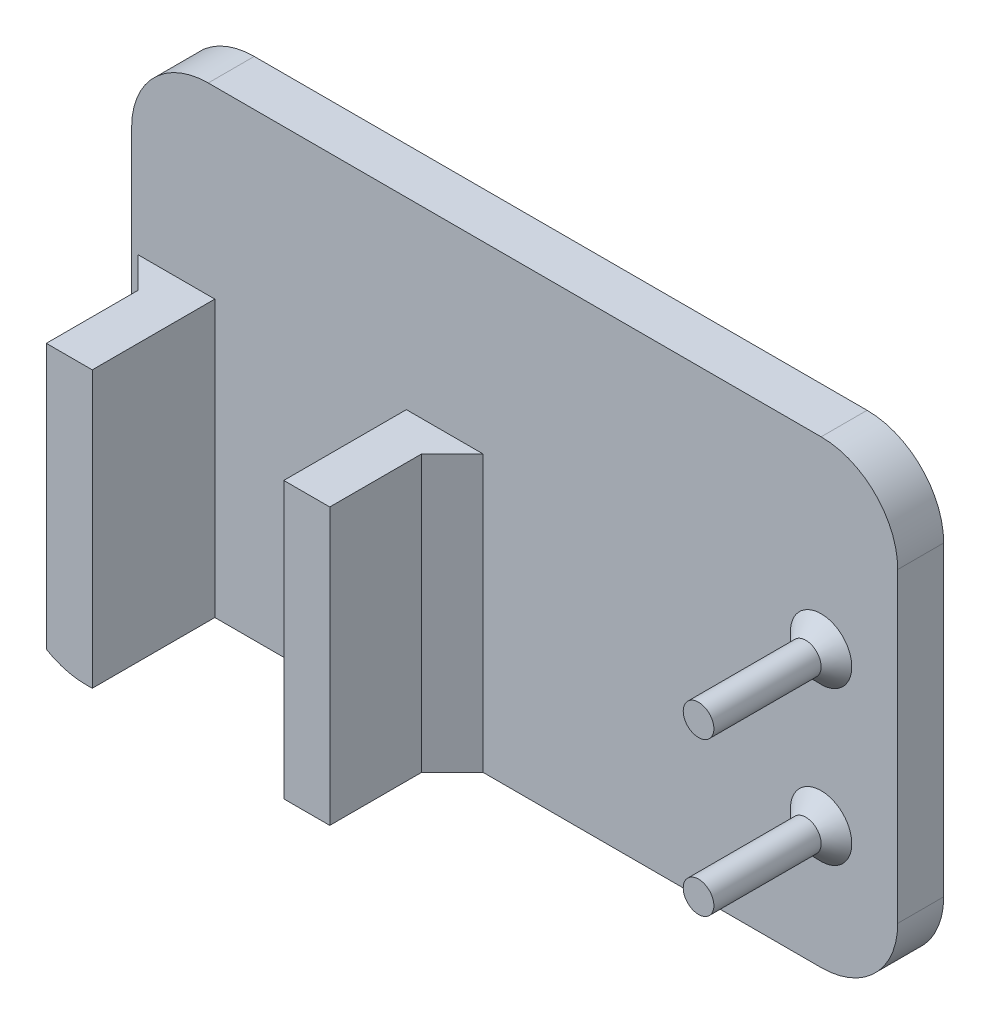
ISO-10303-21;
HEADER;
FILE_DESCRIPTION(('STEP AP214'),'2;1');
FILE_NAME('part.step','',(''),(''),'','','');
FILE_SCHEMA(('AUTOMOTIVE_DESIGN { 1 0 10303 214 1 1 1 1 }'));
ENDSEC;
DATA;
#1=APPLICATION_CONTEXT('core data for automotive mechanical design processes');
#2=APPLICATION_PROTOCOL_DEFINITION('international standard','automotive_design',2000,#1);
#3=PRODUCT_CONTEXT('',#1,'mechanical');
#4=PRODUCT('Part','Part','',(#3));
#5=PRODUCT_RELATED_PRODUCT_CATEGORY('part','',(#4));
#6=PRODUCT_DEFINITION_FORMATION('','',#4);
#7=PRODUCT_DEFINITION_CONTEXT('part definition',#1,'design');
#8=PRODUCT_DEFINITION('design','',#6,#7);
#9=PRODUCT_DEFINITION_SHAPE('','',#8);
#10=(LENGTH_UNIT() NAMED_UNIT(*) SI_UNIT(.MILLI.,.METRE.));
#11=(NAMED_UNIT(*) PLANE_ANGLE_UNIT() SI_UNIT($,.RADIAN.));
#12=(NAMED_UNIT(*) SI_UNIT($,.STERADIAN.) SOLID_ANGLE_UNIT());
#13=UNCERTAINTY_MEASURE_WITH_UNIT(LENGTH_MEASURE(1.E-05),#10,'distance_accuracy_value','');
#14=(GEOMETRIC_REPRESENTATION_CONTEXT(3) GLOBAL_UNCERTAINTY_ASSIGNED_CONTEXT((#13)) GLOBAL_UNIT_ASSIGNED_CONTEXT((#10,
#11,#12)) REPRESENTATION_CONTEXT('',''));
#15=CARTESIAN_POINT('',(0.,0.,0.));
#16=DIRECTION('',(0.,0.,1.));
#17=DIRECTION('',(1.,0.,0.));
#18=AXIS2_PLACEMENT_3D('',#15,#16,#17);
#19=CARTESIAN_POINT('',(0.,0.,3.));
#20=DIRECTION('',(0.,0.,-1.));
#21=DIRECTION('',(-1.,0.,0.));
#22=AXIS2_PLACEMENT_3D('',#19,#20,#21);
#23=PLANE('',#22);
#24=CARTESIAN_POINT('',(45.,18.,3.));
#25=DIRECTION('',(0.,0.,-1.));
#26=DIRECTION('',(-1.,0.,0.));
#27=AXIS2_PLACEMENT_3D('',#24,#25,#26);
#28=CIRCLE('',#27,2.);
#29=CARTESIAN_POINT('',(43.,18.,3.));
#30=VERTEX_POINT('',#29);
#31=EDGE_CURVE('E48',#30,#30,#28,.T.);
#32=ORIENTED_EDGE('',*,*,#31,.T.);
#33=EDGE_LOOP('',(#32));
#34=FACE_BOUND('',#33,.T.);
#35=CARTESIAN_POINT('',(45.,8.00000000000001,3.));
#36=DIRECTION('',(0.,0.,-1.));
#37=DIRECTION('',(-1.,0.,0.));
#38=AXIS2_PLACEMENT_3D('',#35,#36,#37);
#39=CIRCLE('',#38,2.);
#40=CARTESIAN_POINT('',(43.,8.00000000000001,3.));
#41=VERTEX_POINT('',#40);
#42=EDGE_CURVE('E368',#41,#41,#39,.T.);
#43=ORIENTED_EDGE('',*,*,#42,.T.);
#44=EDGE_LOOP('',(#43));
#45=FACE_BOUND('',#44,.T.);
#46=DIRECTION('',(0.,-1.,0.));
#47=VECTOR('',#46,1.);
#48=CARTESIAN_POINT('',(0.,0.,3.));
#49=LINE('',#48,#47);
#50=CARTESIAN_POINT('',(0.,25.,3.));
#51=VERTEX_POINT('',#50);
#52=CARTESIAN_POINT('',(0.,5.,3.));
#53=VERTEX_POINT('',#52);
#54=EDGE_CURVE('E251',#51,#53,#49,.T.);
#55=ORIENTED_EDGE('',*,*,#54,.T.);
#56=CARTESIAN_POINT('',(5.,5.,3.));
#57=DIRECTION('',(0.,0.,-1.));
#58=DIRECTION('',(-1.,0.,0.));
#59=AXIS2_PLACEMENT_3D('',#56,#57,#58);
#60=CIRCLE('',#59,5.);
#61=CARTESIAN_POINT('',(0.430461557222115,2.97038958911444,3.));
#62=VERTEX_POINT('',#61);
#63=EDGE_CURVE('E340',#53,#62,#60,.F.);
#64=ORIENTED_EDGE('',*,*,#63,.T.);
#65=DIRECTION('',(0.,1.,0.));
#66=VECTOR('',#65,1.);
#67=CARTESIAN_POINT('',(0.430461557222114,18.,3.));
#68=LINE('',#67,#66);
#69=CARTESIAN_POINT('',(0.430461557222114,18.,3.));
#70=VERTEX_POINT('',#69);
#71=EDGE_CURVE('E269',#62,#70,#68,.T.);
#72=ORIENTED_EDGE('',*,*,#71,.T.);
#73=DIRECTION('',(-1.,0.,0.));
#74=VECTOR('',#73,1.);
#75=CARTESIAN_POINT('',(0.,18.,3.));
#76=LINE('',#75,#74);
#77=CARTESIAN_POINT('',(5.43046155722212,18.,3.));
#78=VERTEX_POINT('',#77);
#79=EDGE_CURVE('E224',#78,#70,#76,.T.);
#80=ORIENTED_EDGE('',*,*,#79,.F.);
#81=DIRECTION('',(0.,-1.,0.));
#82=VECTOR('',#81,1.);
#83=CARTESIAN_POINT('',(5.43046155722212,0.,3.));
#84=LINE('',#83,#82);
#85=CARTESIAN_POINT('',(5.43046155722212,0.,3.));
#86=VERTEX_POINT('',#85);
#87=EDGE_CURVE('E180',#78,#86,#84,.T.);
#88=ORIENTED_EDGE('',*,*,#87,.T.);
#89=DIRECTION('',(1.,0.,0.));
#90=VECTOR('',#89,1.);
#91=CARTESIAN_POINT('',(0.,0.,3.));
#92=LINE('',#91,#90);
#93=CARTESIAN_POINT('',(17.9304615572221,0.,3.));
#94=VERTEX_POINT('',#93);
#95=EDGE_CURVE('E260',#86,#94,#92,.T.);
#96=ORIENTED_EDGE('',*,*,#95,.T.);
#97=DIRECTION('',(0.,-1.,0.));
#98=VECTOR('',#97,1.);
#99=CARTESIAN_POINT('',(17.9304615572221,0.,3.));
#100=LINE('',#99,#98);
#101=CARTESIAN_POINT('',(17.9304615572221,18.,3.));
#102=VERTEX_POINT('',#101);
#103=EDGE_CURVE('E196',#102,#94,#100,.T.);
#104=ORIENTED_EDGE('',*,*,#103,.F.);
#105=DIRECTION('',(1.,0.,0.));
#106=VECTOR('',#105,1.);
#107=CARTESIAN_POINT('',(0.,18.,3.));
#108=LINE('',#107,#106);
#109=CARTESIAN_POINT('',(22.9304615572221,18.,3.));
#110=VERTEX_POINT('',#109);
#111=EDGE_CURVE('E176',#102,#110,#108,.T.);
#112=ORIENTED_EDGE('',*,*,#111,.T.);
#113=DIRECTION('',(0.,-1.,0.));
#114=VECTOR('',#113,1.);
#115=CARTESIAN_POINT('',(22.9304615572221,0.,3.));
#116=LINE('',#115,#114);
#117=CARTESIAN_POINT('',(22.9304615572221,0.,3.));
#118=VERTEX_POINT('',#117);
#119=EDGE_CURVE('E286',#110,#118,#116,.T.);
#120=ORIENTED_EDGE('',*,*,#119,.T.);
#121=CARTESIAN_POINT('',(45.,0.,3.));
#122=VERTEX_POINT('',#121);
#123=EDGE_CURVE('E255',#118,#122,#92,.T.);
#124=ORIENTED_EDGE('',*,*,#123,.T.);
#125=CARTESIAN_POINT('',(45.,5.,3.));
#126=DIRECTION('',(0.,0.,-1.));
#127=DIRECTION('',(-1.,0.,0.));
#128=AXIS2_PLACEMENT_3D('',#125,#126,#127);
#129=CIRCLE('',#128,5.);
#130=CARTESIAN_POINT('',(50.,5.,3.));
#131=VERTEX_POINT('',#130);
#132=EDGE_CURVE('E337',#122,#131,#129,.F.);
#133=ORIENTED_EDGE('',*,*,#132,.T.);
#134=DIRECTION('',(0.,1.,0.));
#135=VECTOR('',#134,1.);
#136=CARTESIAN_POINT('',(50.,0.,3.));
#137=LINE('',#136,#135);
#138=CARTESIAN_POINT('',(50.,25.,3.));
#139=VERTEX_POINT('',#138);
#140=EDGE_CURVE('E261',#131,#139,#137,.T.);
#141=ORIENTED_EDGE('',*,*,#140,.T.);
#142=CARTESIAN_POINT('',(45.,25.,3.));
#143=DIRECTION('',(0.,0.,-1.));
#144=DIRECTION('',(-1.,0.,0.));
#145=AXIS2_PLACEMENT_3D('',#142,#143,#144);
#146=CIRCLE('',#145,5.);
#147=CARTESIAN_POINT('',(45.,30.,3.));
#148=VERTEX_POINT('',#147);
#149=EDGE_CURVE('E334',#139,#148,#146,.F.);
#150=ORIENTED_EDGE('',*,*,#149,.T.);
#151=DIRECTION('',(-1.,0.,0.));
#152=VECTOR('',#151,1.);
#153=CARTESIAN_POINT('',(0.,30.,3.));
#154=LINE('',#153,#152);
#155=CARTESIAN_POINT('',(5.,30.,3.));
#156=VERTEX_POINT('',#155);
#157=EDGE_CURVE('E265',#148,#156,#154,.T.);
#158=ORIENTED_EDGE('',*,*,#157,.T.);
#159=CARTESIAN_POINT('',(5.,25.,3.));
#160=DIRECTION('',(0.,0.,-1.));
#161=DIRECTION('',(-1.,0.,0.));
#162=AXIS2_PLACEMENT_3D('',#159,#160,#161);
#163=CIRCLE('',#162,5.);
#164=EDGE_CURVE('E331',#156,#51,#163,.F.);
#165=ORIENTED_EDGE('',*,*,#164,.T.);
#166=EDGE_LOOP('',(#55,#64,#72,#80,#88,#96,#104,#112,#120,#124,#133,#141,#150,#158,#165));
#167=FACE_BOUND('',#166,.T.);
#168=ADVANCED_FACE('F39',(#34,#45,#167),#23,.F.);
#169=CARTESIAN_POINT('',(0.,0.,3.));
#170=DIRECTION('',(1.,0.,0.));
#171=DIRECTION('',(0.,0.,-1.));
#172=AXIS2_PLACEMENT_3D('',#169,#170,#171);
#173=PLANE('',#172);
#174=DIRECTION('',(0.,-1.,0.));
#175=VECTOR('',#174,1.);
#176=CARTESIAN_POINT('',(0.,0.,0.));
#177=LINE('',#176,#175);
#178=CARTESIAN_POINT('',(0.,25.,0.));
#179=VERTEX_POINT('',#178);
#180=CARTESIAN_POINT('',(0.,5.,0.));
#181=VERTEX_POINT('',#180);
#182=EDGE_CURVE('E250',#179,#181,#177,.T.);
#183=ORIENTED_EDGE('',*,*,#182,.T.);
#184=DIRECTION('',(0.,0.,-1.));
#185=VECTOR('',#184,1.);
#186=CARTESIAN_POINT('',(0.,5.,3.));
#187=LINE('',#186,#185);
#188=EDGE_CURVE('E328',#181,#53,#187,.F.);
#189=ORIENTED_EDGE('',*,*,#188,.T.);
#190=ORIENTED_EDGE('',*,*,#54,.F.);
#191=DIRECTION('',(0.,0.,-1.));
#192=VECTOR('',#191,1.);
#193=CARTESIAN_POINT('',(0.,25.,3.));
#194=LINE('',#193,#192);
#195=EDGE_CURVE('E324',#51,#179,#194,.T.);
#196=ORIENTED_EDGE('',*,*,#195,.T.);
#197=EDGE_LOOP('',(#183,#189,#190,#196));
#198=FACE_BOUND('',#197,.T.);
#199=ADVANCED_FACE('F411',(#198),#173,.F.);
#200=CARTESIAN_POINT('',(0.,0.,3.));
#201=DIRECTION('',(0.,1.,0.));
#202=DIRECTION('',(0.,0.,1.));
#203=AXIS2_PLACEMENT_3D('',#200,#201,#202);
#204=PLANE('',#203);
#205=DIRECTION('',(1.,0.,0.));
#206=VECTOR('',#205,1.);
#207=CARTESIAN_POINT('',(0.,0.,11.));
#208=LINE('',#207,#206);
#209=CARTESIAN_POINT('',(5.,0.,11.));
#210=VERTEX_POINT('',#209);
#211=CARTESIAN_POINT('',(5.43046155722212,0.,11.));
#212=VERTEX_POINT('',#211);
#213=EDGE_CURVE('E230',#210,#212,#208,.T.);
#214=ORIENTED_EDGE('',*,*,#213,.F.);
#215=DIRECTION('',(0.,0.,-1.));
#216=VECTOR('',#215,1.);
#217=CARTESIAN_POINT('',(5.,0.,3.));
#218=LINE('',#217,#216);
#219=CARTESIAN_POINT('',(5.,0.,0.));
#220=VERTEX_POINT('',#219);
#221=EDGE_CURVE('E308',#210,#220,#218,.T.);
#222=ORIENTED_EDGE('',*,*,#221,.T.);
#223=DIRECTION('',(1.,0.,0.));
#224=VECTOR('',#223,1.);
#225=CARTESIAN_POINT('',(0.,0.,0.));
#226=LINE('',#225,#224);
#227=CARTESIAN_POINT('',(45.,0.,0.));
#228=VERTEX_POINT('',#227);
#229=EDGE_CURVE('E273',#220,#228,#226,.T.);
#230=ORIENTED_EDGE('',*,*,#229,.T.);
#231=DIRECTION('',(0.,0.,-1.));
#232=VECTOR('',#231,1.);
#233=CARTESIAN_POINT('',(45.,0.,3.));
#234=LINE('',#233,#232);
#235=EDGE_CURVE('E305',#228,#122,#234,.F.);
#236=ORIENTED_EDGE('',*,*,#235,.T.);
#237=ORIENTED_EDGE('',*,*,#123,.F.);
#238=DIRECTION('',(-0.707106781186551,0.,0.707106781186544));
#239=VECTOR('',#238,1.);
#240=CARTESIAN_POINT('',(11.4652307786109,0.,14.4652307786111));
#241=LINE('',#240,#239);
#242=CARTESIAN_POINT('',(20.9304615572221,0.,4.99999999999999));
#243=VERTEX_POINT('',#242);
#244=EDGE_CURVE('E296',#118,#243,#241,.T.);
#245=ORIENTED_EDGE('',*,*,#244,.T.);
#246=DIRECTION('',(0.,0.,-1.));
#247=VECTOR('',#246,1.);
#248=CARTESIAN_POINT('',(20.9304615572221,0.,11.));
#249=LINE('',#248,#247);
#250=CARTESIAN_POINT('',(20.9304615572221,0.,11.));
#251=VERTEX_POINT('',#250);
#252=EDGE_CURVE('E213',#251,#243,#249,.T.);
#253=ORIENTED_EDGE('',*,*,#252,.F.);
#254=DIRECTION('',(1.,0.,0.));
#255=VECTOR('',#254,1.);
#256=CARTESIAN_POINT('',(0.,0.,11.));
#257=LINE('',#256,#255);
#258=CARTESIAN_POINT('',(17.9304615572221,0.,11.));
#259=VERTEX_POINT('',#258);
#260=EDGE_CURVE('E190',#259,#251,#257,.T.);
#261=ORIENTED_EDGE('',*,*,#260,.F.);
#262=DIRECTION('',(0.,0.,-1.));
#263=VECTOR('',#262,1.);
#264=CARTESIAN_POINT('',(17.9304615572221,0.,11.));
#265=LINE('',#264,#263);
#266=EDGE_CURVE('E181',#259,#94,#265,.T.);
#267=ORIENTED_EDGE('',*,*,#266,.T.);
#268=ORIENTED_EDGE('',*,*,#95,.F.);
#269=DIRECTION('',(0.,0.,-1.));
#270=VECTOR('',#269,1.);
#271=CARTESIAN_POINT('',(5.43046155722212,0.,11.));
#272=LINE('',#271,#270);
#273=EDGE_CURVE('E233',#212,#86,#272,.T.);
#274=ORIENTED_EDGE('',*,*,#273,.F.);
#275=EDGE_LOOP('',(#214,#222,#230,#236,#237,#245,#253,#261,#267,#268,#274));
#276=FACE_BOUND('',#275,.T.);
#277=ADVANCED_FACE('F416',(#276),#204,.F.);
#278=CARTESIAN_POINT('',(50.,0.,3.));
#279=DIRECTION('',(-1.,0.,0.));
#280=DIRECTION('',(0.,0.,1.));
#281=AXIS2_PLACEMENT_3D('',#278,#279,#280);
#282=PLANE('',#281);
#283=ORIENTED_EDGE('',*,*,#140,.F.);
#284=DIRECTION('',(0.,0.,-1.));
#285=VECTOR('',#284,1.);
#286=CARTESIAN_POINT('',(50.,5.,3.));
#287=LINE('',#286,#285);
#288=CARTESIAN_POINT('',(50.,5.,0.));
#289=VERTEX_POINT('',#288);
#290=EDGE_CURVE('E353',#131,#289,#287,.T.);
#291=ORIENTED_EDGE('',*,*,#290,.T.);
#292=DIRECTION('',(0.,1.,0.));
#293=VECTOR('',#292,1.);
#294=CARTESIAN_POINT('',(50.,0.,0.));
#295=LINE('',#294,#293);
#296=CARTESIAN_POINT('',(50.,25.,0.));
#297=VERTEX_POINT('',#296);
#298=EDGE_CURVE('E277',#289,#297,#295,.T.);
#299=ORIENTED_EDGE('',*,*,#298,.T.);
#300=DIRECTION('',(0.,0.,-1.));
#301=VECTOR('',#300,1.);
#302=CARTESIAN_POINT('',(50.,25.,3.));
#303=LINE('',#302,#301);
#304=EDGE_CURVE('E350',#297,#139,#303,.F.);
#305=ORIENTED_EDGE('',*,*,#304,.T.);
#306=EDGE_LOOP('',(#283,#291,#299,#305));
#307=FACE_BOUND('',#306,.T.);
#308=ADVANCED_FACE('F430',(#307),#282,.F.);
#309=CARTESIAN_POINT('',(0.,30.,3.));
#310=DIRECTION('',(0.,-1.,0.));
#311=DIRECTION('',(0.,0.,-1.));
#312=AXIS2_PLACEMENT_3D('',#309,#310,#311);
#313=PLANE('',#312);
#314=ORIENTED_EDGE('',*,*,#157,.F.);
#315=DIRECTION('',(0.,0.,-1.));
#316=VECTOR('',#315,1.);
#317=CARTESIAN_POINT('',(45.,30.,3.));
#318=LINE('',#317,#316);
#319=CARTESIAN_POINT('',(45.,30.,0.));
#320=VERTEX_POINT('',#319);
#321=EDGE_CURVE('E360',#148,#320,#318,.T.);
#322=ORIENTED_EDGE('',*,*,#321,.T.);
#323=DIRECTION('',(-1.,0.,0.));
#324=VECTOR('',#323,1.);
#325=CARTESIAN_POINT('',(0.,30.,0.));
#326=LINE('',#325,#324);
#327=CARTESIAN_POINT('',(5.,30.,0.));
#328=VERTEX_POINT('',#327);
#329=EDGE_CURVE('E256',#320,#328,#326,.T.);
#330=ORIENTED_EDGE('',*,*,#329,.T.);
#331=DIRECTION('',(0.,0.,-1.));
#332=VECTOR('',#331,1.);
#333=CARTESIAN_POINT('',(5.,30.,3.));
#334=LINE('',#333,#332);
#335=EDGE_CURVE('E357',#328,#156,#334,.F.);
#336=ORIENTED_EDGE('',*,*,#335,.T.);
#337=EDGE_LOOP('',(#314,#322,#330,#336));
#338=FACE_BOUND('',#337,.T.);
#339=ADVANCED_FACE('F426',(#338),#313,.F.);
#340=CARTESIAN_POINT('',(0.,0.,0.));
#341=DIRECTION('',(0.,0.,-1.));
#342=DIRECTION('',(-1.,0.,0.));
#343=AXIS2_PLACEMENT_3D('',#340,#341,#342);
#344=PLANE('',#343);
#345=ORIENTED_EDGE('',*,*,#229,.F.);
#346=CARTESIAN_POINT('',(5.,5.,0.));
#347=DIRECTION('',(0.,0.,-1.));
#348=DIRECTION('',(-1.,0.,0.));
#349=AXIS2_PLACEMENT_3D('',#346,#347,#348);
#350=CIRCLE('',#349,5.);
#351=EDGE_CURVE('E321',#220,#181,#350,.T.);
#352=ORIENTED_EDGE('',*,*,#351,.T.);
#353=ORIENTED_EDGE('',*,*,#182,.F.);
#354=CARTESIAN_POINT('',(5.,25.,0.));
#355=DIRECTION('',(0.,0.,-1.));
#356=DIRECTION('',(-1.,0.,0.));
#357=AXIS2_PLACEMENT_3D('',#354,#355,#356);
#358=CIRCLE('',#357,5.);
#359=EDGE_CURVE('E312',#179,#328,#358,.T.);
#360=ORIENTED_EDGE('',*,*,#359,.T.);
#361=ORIENTED_EDGE('',*,*,#329,.F.);
#362=CARTESIAN_POINT('',(45.,25.,0.));
#363=DIRECTION('',(0.,0.,-1.));
#364=DIRECTION('',(-1.,0.,0.));
#365=AXIS2_PLACEMENT_3D('',#362,#363,#364);
#366=CIRCLE('',#365,5.);
#367=EDGE_CURVE('E315',#320,#297,#366,.T.);
#368=ORIENTED_EDGE('',*,*,#367,.T.);
#369=ORIENTED_EDGE('',*,*,#298,.F.);
#370=CARTESIAN_POINT('',(45.,5.,0.));
#371=DIRECTION('',(0.,0.,-1.));
#372=DIRECTION('',(-1.,0.,0.));
#373=AXIS2_PLACEMENT_3D('',#370,#371,#372);
#374=CIRCLE('',#373,5.);
#375=EDGE_CURVE('E318',#289,#228,#374,.T.);
#376=ORIENTED_EDGE('',*,*,#375,.T.);
#377=EDGE_LOOP('',(#345,#352,#353,#360,#361,#368,#369,#376));
#378=FACE_BOUND('',#377,.T.);
#379=ADVANCED_FACE('F423',(#378),#344,.T.);
#380=CARTESIAN_POINT('',(5.43046155722212,0.,11.));
#381=DIRECTION('',(1.,0.,0.));
#382=DIRECTION('',(0.,1.,0.));
#383=AXIS2_PLACEMENT_3D('',#380,#381,#382);
#384=PLANE('',#383);
#385=ORIENTED_EDGE('',*,*,#87,.F.);
#386=DIRECTION('',(0.,0.,-1.));
#387=VECTOR('',#386,1.);
#388=CARTESIAN_POINT('',(5.43046155722212,18.,11.));
#389=LINE('',#388,#387);
#390=CARTESIAN_POINT('',(5.43046155722212,18.,11.));
#391=VERTEX_POINT('',#390);
#392=EDGE_CURVE('E246',#391,#78,#389,.T.);
#393=ORIENTED_EDGE('',*,*,#392,.F.);
#394=DIRECTION('',(0.,-1.,0.));
#395=VECTOR('',#394,1.);
#396=CARTESIAN_POINT('',(5.43046155722212,0.,11.));
#397=LINE('',#396,#395);
#398=EDGE_CURVE('E219',#391,#212,#397,.T.);
#399=ORIENTED_EDGE('',*,*,#398,.T.);
#400=ORIENTED_EDGE('',*,*,#273,.T.);
#401=EDGE_LOOP('',(#385,#393,#399,#400));
#402=FACE_BOUND('',#401,.T.);
#403=ADVANCED_FACE('F421',(#402),#384,.T.);
#404=CARTESIAN_POINT('',(0.,18.,11.));
#405=DIRECTION('',(0.,-1.,0.));
#406=DIRECTION('',(0.,0.,-1.));
#407=AXIS2_PLACEMENT_3D('',#404,#405,#406);
#408=PLANE('',#407);
#409=ORIENTED_EDGE('',*,*,#79,.T.);
#410=DIRECTION('',(-0.707106781186545,0.,-0.70710678118655));
#411=VECTOR('',#410,1.);
#412=CARTESIAN_POINT('',(4.21523077861106,18.,6.78476922138897));
#413=LINE('',#412,#411);
#414=CARTESIAN_POINT('',(2.43046155722211,18.,5.00000000000002));
#415=VERTEX_POINT('',#414);
#416=EDGE_CURVE('E302',#70,#415,#413,.F.);
#417=ORIENTED_EDGE('',*,*,#416,.T.);
#418=DIRECTION('',(0.,0.,-1.));
#419=VECTOR('',#418,1.);
#420=CARTESIAN_POINT('',(2.43046155722211,18.,11.));
#421=LINE('',#420,#419);
#422=CARTESIAN_POINT('',(2.43046155722211,18.,11.));
#423=VERTEX_POINT('',#422);
#424=EDGE_CURVE('E242',#423,#415,#421,.T.);
#425=ORIENTED_EDGE('',*,*,#424,.F.);
#426=DIRECTION('',(-1.,0.,0.));
#427=VECTOR('',#426,1.);
#428=CARTESIAN_POINT('',(0.,18.,11.));
#429=LINE('',#428,#427);
#430=EDGE_CURVE('E223',#391,#423,#429,.T.);
#431=ORIENTED_EDGE('',*,*,#430,.F.);
#432=ORIENTED_EDGE('',*,*,#392,.T.);
#433=EDGE_LOOP('',(#409,#417,#425,#431,#432));
#434=FACE_BOUND('',#433,.T.);
#435=ADVANCED_FACE('F473',(#434),#408,.F.);
#436=CARTESIAN_POINT('',(2.43046155722212,0.,11.));
#437=DIRECTION('',(1.,0.,0.));
#438=DIRECTION('',(0.,1.,0.));
#439=AXIS2_PLACEMENT_3D('',#436,#437,#438);
#440=PLANE('',#439);
#441=DIRECTION('',(0.,-1.,0.));
#442=VECTOR('',#441,1.);
#443=CARTESIAN_POINT('',(2.43046155722212,0.,5.00000000000002));
#444=LINE('',#443,#442);
#445=CARTESIAN_POINT('',(2.43046155722212,0.710772541460804,5.00000000000002));
#446=VERTEX_POINT('',#445);
#447=EDGE_CURVE('E293',#415,#446,#444,.T.);
#448=ORIENTED_EDGE('',*,*,#447,.T.);
#449=DIRECTION('',(0.,0.,-1.));
#450=VECTOR('',#449,1.);
#451=CARTESIAN_POINT('',(2.43046155722212,0.710772541460804,5.00000000000002));
#452=LINE('',#451,#450);
#453=CARTESIAN_POINT('',(2.43046155722212,0.710772541460804,11.));
#454=VERTEX_POINT('',#453);
#455=EDGE_CURVE('E55',#446,#454,#452,.F.);
#456=ORIENTED_EDGE('',*,*,#455,.T.);
#457=DIRECTION('',(0.,-1.,0.));
#458=VECTOR('',#457,1.);
#459=CARTESIAN_POINT('',(2.43046155722212,0.,11.));
#460=LINE('',#459,#458);
#461=EDGE_CURVE('E227',#423,#454,#460,.T.);
#462=ORIENTED_EDGE('',*,*,#461,.F.);
#463=ORIENTED_EDGE('',*,*,#424,.T.);
#464=EDGE_LOOP('',(#448,#456,#462,#463));
#465=FACE_BOUND('',#464,.T.);
#466=ADVANCED_FACE('F475',(#465),#440,.F.);
#467=CARTESIAN_POINT('',(0.,0.,11.));
#468=DIRECTION('',(0.,0.,1.));
#469=DIRECTION('',(1.,0.,0.));
#470=AXIS2_PLACEMENT_3D('',#467,#468,#469);
#471=PLANE('',#470);
#472=ORIENTED_EDGE('',*,*,#461,.T.);
#473=CARTESIAN_POINT('',(5.,5.,11.));
#474=DIRECTION('',(0.,0.,1.));
#475=DIRECTION('',(1.,0.,0.));
#476=AXIS2_PLACEMENT_3D('',#473,#474,#475);
#477=CIRCLE('',#476,5.);
#478=EDGE_CURVE('E347',#454,#210,#477,.T.);
#479=ORIENTED_EDGE('',*,*,#478,.T.);
#480=ORIENTED_EDGE('',*,*,#213,.T.);
#481=ORIENTED_EDGE('',*,*,#398,.F.);
#482=ORIENTED_EDGE('',*,*,#430,.T.);
#483=EDGE_LOOP('',(#472,#479,#480,#481,#482));
#484=FACE_BOUND('',#483,.T.);
#485=ADVANCED_FACE('F478',(#484),#471,.T.);
#486=CARTESIAN_POINT('',(0.,18.,11.));
#487=DIRECTION('',(0.,1.,0.));
#488=DIRECTION('',(-1.,0.,0.));
#489=AXIS2_PLACEMENT_3D('',#486,#487,#488);
#490=PLANE('',#489);
#491=ORIENTED_EDGE('',*,*,#111,.F.);
#492=DIRECTION('',(0.,0.,-1.));
#493=VECTOR('',#492,1.);
#494=CARTESIAN_POINT('',(17.9304615572221,18.,11.));
#495=LINE('',#494,#493);
#496=CARTESIAN_POINT('',(17.9304615572221,18.,11.));
#497=VERTEX_POINT('',#496);
#498=EDGE_CURVE('E168',#497,#102,#495,.T.);
#499=ORIENTED_EDGE('',*,*,#498,.F.);
#500=DIRECTION('',(1.,0.,0.));
#501=VECTOR('',#500,1.);
#502=CARTESIAN_POINT('',(0.,18.,11.));
#503=LINE('',#502,#501);
#504=CARTESIAN_POINT('',(20.9304615572221,18.,11.));
#505=VERTEX_POINT('',#504);
#506=EDGE_CURVE('E173',#497,#505,#503,.T.);
#507=ORIENTED_EDGE('',*,*,#506,.T.);
#508=DIRECTION('',(0.,0.,-1.));
#509=VECTOR('',#508,1.);
#510=CARTESIAN_POINT('',(20.9304615572221,18.,11.));
#511=LINE('',#510,#509);
#512=CARTESIAN_POINT('',(20.9304615572221,18.,4.99999999999999));
#513=VERTEX_POINT('',#512);
#514=EDGE_CURVE('E208',#505,#513,#511,.T.);
#515=ORIENTED_EDGE('',*,*,#514,.T.);
#516=DIRECTION('',(0.707106781186551,0.,-0.707106781186544));
#517=VECTOR('',#516,1.);
#518=CARTESIAN_POINT('',(22.9304615572221,18.,2.99999999999999));
#519=LINE('',#518,#517);
#520=EDGE_CURVE('E299',#513,#110,#519,.T.);
#521=ORIENTED_EDGE('',*,*,#520,.T.);
#522=EDGE_LOOP('',(#491,#499,#507,#515,#521));
#523=FACE_BOUND('',#522,.T.);
#524=ADVANCED_FACE('F170',(#523),#490,.T.);
#525=CARTESIAN_POINT('',(17.9304615572221,0.,11.));
#526=DIRECTION('',(1.,0.,0.));
#527=DIRECTION('',(0.,0.,-1.));
#528=AXIS2_PLACEMENT_3D('',#525,#526,#527);
#529=PLANE('',#528);
#530=ORIENTED_EDGE('',*,*,#103,.T.);
#531=ORIENTED_EDGE('',*,*,#266,.F.);
#532=DIRECTION('',(0.,-1.,0.));
#533=VECTOR('',#532,1.);
#534=CARTESIAN_POINT('',(17.9304615572221,0.,11.));
#535=LINE('',#534,#533);
#536=EDGE_CURVE('E184',#497,#259,#535,.T.);
#537=ORIENTED_EDGE('',*,*,#536,.F.);
#538=ORIENTED_EDGE('',*,*,#498,.T.);
#539=EDGE_LOOP('',(#530,#531,#537,#538));
#540=FACE_BOUND('',#539,.T.);
#541=ADVANCED_FACE('F185',(#540),#529,.F.);
#542=CARTESIAN_POINT('',(20.9304615572221,0.,11.));
#543=DIRECTION('',(1.,0.,0.));
#544=DIRECTION('',(0.,0.,-1.));
#545=AXIS2_PLACEMENT_3D('',#542,#543,#544);
#546=PLANE('',#545);
#547=ORIENTED_EDGE('',*,*,#252,.T.);
#548=DIRECTION('',(0.,1.,0.));
#549=VECTOR('',#548,1.);
#550=CARTESIAN_POINT('',(20.9304615572221,0.,4.99999999999999));
#551=LINE('',#550,#549);
#552=EDGE_CURVE('E290',#243,#513,#551,.T.);
#553=ORIENTED_EDGE('',*,*,#552,.T.);
#554=ORIENTED_EDGE('',*,*,#514,.F.);
#555=DIRECTION('',(0.,-1.,0.));
#556=VECTOR('',#555,1.);
#557=CARTESIAN_POINT('',(20.9304615572221,0.,11.));
#558=LINE('',#557,#556);
#559=EDGE_CURVE('E194',#505,#251,#558,.T.);
#560=ORIENTED_EDGE('',*,*,#559,.T.);
#561=EDGE_LOOP('',(#547,#553,#554,#560));
#562=FACE_BOUND('',#561,.T.);
#563=ADVANCED_FACE('F497',(#562),#546,.T.);
#564=CARTESIAN_POINT('',(0.,0.,11.));
#565=DIRECTION('',(0.,0.,1.));
#566=DIRECTION('',(1.,0.,0.));
#567=AXIS2_PLACEMENT_3D('',#564,#565,#566);
#568=PLANE('',#567);
#569=ORIENTED_EDGE('',*,*,#506,.F.);
#570=ORIENTED_EDGE('',*,*,#536,.T.);
#571=ORIENTED_EDGE('',*,*,#260,.T.);
#572=ORIENTED_EDGE('',*,*,#559,.F.);
#573=EDGE_LOOP('',(#569,#570,#571,#572));
#574=FACE_BOUND('',#573,.T.);
#575=ADVANCED_FACE('F192',(#574),#568,.T.);
#576=CARTESIAN_POINT('',(45.,18.,11.));
#577=DIRECTION('',(0.,0.,-1.));
#578=DIRECTION('',(-1.,0.,0.));
#579=AXIS2_PLACEMENT_3D('',#576,#577,#578);
#580=CYLINDRICAL_SURFACE('',#579,0.999999999999998);
#581=CARTESIAN_POINT('',(45.,18.,4.00000000000001));
#582=DIRECTION('',(0.,0.,-1.));
#583=DIRECTION('',(-1.,0.,0.));
#584=AXIS2_PLACEMENT_3D('',#581,#582,#583);
#585=CIRCLE('',#584,0.999999999999998);
#586=CARTESIAN_POINT('',(44.,18.,4.00000000000001));
#587=VERTEX_POINT('',#586);
#588=EDGE_CURVE('E364',#587,#587,#585,.F.);
#589=ORIENTED_EDGE('',*,*,#588,.T.);
#590=EDGE_LOOP('',(#589));
#591=FACE_BOUND('',#590,.T.);
#592=CARTESIAN_POINT('',(45.,18.,11.));
#593=DIRECTION('',(0.,0.,1.));
#594=DIRECTION('',(1.,0.,0.));
#595=AXIS2_PLACEMENT_3D('',#592,#593,#594);
#596=CIRCLE('',#595,0.999999999999998);
#597=CARTESIAN_POINT('',(46.,18.,11.));
#598=VERTEX_POINT('',#597);
#599=EDGE_CURVE('E201',#598,#598,#596,.T.);
#600=ORIENTED_EDGE('',*,*,#599,.F.);
#601=EDGE_LOOP('',(#600));
#602=FACE_BOUND('',#601,.T.);
#603=ADVANCED_FACE('F383',(#591,#602),#580,.T.);
#604=CARTESIAN_POINT('',(0.,0.,11.));
#605=DIRECTION('',(0.,0.,1.));
#606=DIRECTION('',(1.,0.,0.));
#607=AXIS2_PLACEMENT_3D('',#604,#605,#606);
#608=PLANE('',#607);
#609=ORIENTED_EDGE('',*,*,#599,.T.);
#610=EDGE_LOOP('',(#609));
#611=FACE_BOUND('',#610,.T.);
#612=ADVANCED_FACE('F386',(#611),#608,.T.);
#613=CARTESIAN_POINT('',(45.,8.00000000000001,11.));
#614=DIRECTION('',(0.,0.,-1.));
#615=DIRECTION('',(-1.,0.,0.));
#616=AXIS2_PLACEMENT_3D('',#613,#614,#615);
#617=CYLINDRICAL_SURFACE('',#616,1.00000000000001);
#618=CARTESIAN_POINT('',(45.,8.00000000000001,4.00000000000001));
#619=DIRECTION('',(0.,0.,-1.));
#620=DIRECTION('',(-1.,0.,0.));
#621=AXIS2_PLACEMENT_3D('',#618,#619,#620);
#622=CIRCLE('',#621,1.00000000000001);
#623=CARTESIAN_POINT('',(44.,8.00000000000001,4.00000000000001));
#624=VERTEX_POINT('',#623);
#625=EDGE_CURVE('E11',#624,#624,#622,.F.);
#626=ORIENTED_EDGE('',*,*,#625,.T.);
#627=EDGE_LOOP('',(#626));
#628=FACE_BOUND('',#627,.T.);
#629=CARTESIAN_POINT('',(45.,8.00000000000001,11.));
#630=DIRECTION('',(0.,0.,1.));
#631=DIRECTION('',(1.,0.,0.));
#632=AXIS2_PLACEMENT_3D('',#629,#630,#631);
#633=CIRCLE('',#632,1.00000000000001);
#634=CARTESIAN_POINT('',(46.,8.00000000000001,11.));
#635=VERTEX_POINT('',#634);
#636=EDGE_CURVE('E392',#635,#635,#633,.T.);
#637=ORIENTED_EDGE('',*,*,#636,.F.);
#638=EDGE_LOOP('',(#637));
#639=FACE_BOUND('',#638,.T.);
#640=ADVANCED_FACE('F399',(#628,#639),#617,.T.);
#641=CARTESIAN_POINT('',(0.,0.,11.));
#642=DIRECTION('',(0.,0.,1.));
#643=DIRECTION('',(1.,0.,0.));
#644=AXIS2_PLACEMENT_3D('',#641,#642,#643);
#645=PLANE('',#644);
#646=ORIENTED_EDGE('',*,*,#636,.T.);
#647=EDGE_LOOP('',(#646));
#648=FACE_BOUND('',#647,.T.);
#649=ADVANCED_FACE('F397',(#648),#645,.T.);
#650=CARTESIAN_POINT('',(22.9304615572221,0.,3.));
#651=DIRECTION('',(-0.707106781186544,0.,-0.707106781186551));
#652=DIRECTION('',(0.,-1.,0.));
#653=AXIS2_PLACEMENT_3D('',#650,#651,#652);
#654=PLANE('',#653);
#655=ORIENTED_EDGE('',*,*,#520,.F.);
#656=ORIENTED_EDGE('',*,*,#552,.F.);
#657=ORIENTED_EDGE('',*,*,#244,.F.);
#658=ORIENTED_EDGE('',*,*,#119,.F.);
#659=EDGE_LOOP('',(#655,#656,#657,#658));
#660=FACE_BOUND('',#659,.T.);
#661=ADVANCED_FACE('F407',(#660),#654,.F.);
#662=CARTESIAN_POINT('',(2.43046155722212,0.,5.00000000000002));
#663=DIRECTION('',(-0.70710678118655,0.,0.707106781186545));
#664=DIRECTION('',(0.,1.,0.));
#665=AXIS2_PLACEMENT_3D('',#662,#663,#664);
#666=PLANE('',#665);
#667=ORIENTED_EDGE('',*,*,#71,.F.);
#668=CARTESIAN_POINT('',(5.,5.,7.56953844277792));
#669=DIRECTION('',(-0.70710678118655,0.,0.707106781186545));
#670=DIRECTION('',(-0.707106781186545,0.,-0.70710678118655));
#671=AXIS2_PLACEMENT_3D('',#668,#669,#670);
#672=ELLIPSE('',#671,7.0710678118655,5.);
#673=EDGE_CURVE('E63',#62,#446,#672,.T.);
#674=ORIENTED_EDGE('',*,*,#673,.T.);
#675=ORIENTED_EDGE('',*,*,#447,.F.);
#676=ORIENTED_EDGE('',*,*,#416,.F.);
#677=EDGE_LOOP('',(#667,#674,#675,#676));
#678=FACE_BOUND('',#677,.T.);
#679=ADVANCED_FACE('F440',(#678),#666,.T.);
#680=CARTESIAN_POINT('',(5.,5.,3.));
#681=DIRECTION('',(0.,0.,-1.));
#682=DIRECTION('',(-1.,0.,0.));
#683=AXIS2_PLACEMENT_3D('',#680,#681,#682);
#684=CYLINDRICAL_SURFACE('',#683,5.);
#685=ORIENTED_EDGE('',*,*,#63,.F.);
#686=ORIENTED_EDGE('',*,*,#188,.F.);
#687=ORIENTED_EDGE('',*,*,#351,.F.);
#688=ORIENTED_EDGE('',*,*,#221,.F.);
#689=ORIENTED_EDGE('',*,*,#478,.F.);
#690=ORIENTED_EDGE('',*,*,#455,.F.);
#691=ORIENTED_EDGE('',*,*,#673,.F.);
#692=EDGE_LOOP('',(#685,#686,#687,#688,#689,#690,#691));
#693=FACE_BOUND('',#692,.T.);
#694=ADVANCED_FACE('F444',(#693),#684,.T.);
#695=CARTESIAN_POINT('',(45.,5.,3.));
#696=DIRECTION('',(0.,0.,-1.));
#697=DIRECTION('',(-1.,0.,0.));
#698=AXIS2_PLACEMENT_3D('',#695,#696,#697);
#699=CYLINDRICAL_SURFACE('',#698,5.);
#700=ORIENTED_EDGE('',*,*,#132,.F.);
#701=ORIENTED_EDGE('',*,*,#235,.F.);
#702=ORIENTED_EDGE('',*,*,#375,.F.);
#703=ORIENTED_EDGE('',*,*,#290,.F.);
#704=EDGE_LOOP('',(#700,#701,#702,#703));
#705=FACE_BOUND('',#704,.T.);
#706=ADVANCED_FACE('F447',(#705),#699,.T.);
#707=CARTESIAN_POINT('',(45.,25.,3.));
#708=DIRECTION('',(0.,0.,-1.));
#709=DIRECTION('',(-1.,0.,0.));
#710=AXIS2_PLACEMENT_3D('',#707,#708,#709);
#711=CYLINDRICAL_SURFACE('',#710,5.);
#712=ORIENTED_EDGE('',*,*,#149,.F.);
#713=ORIENTED_EDGE('',*,*,#304,.F.);
#714=ORIENTED_EDGE('',*,*,#367,.F.);
#715=ORIENTED_EDGE('',*,*,#321,.F.);
#716=EDGE_LOOP('',(#712,#713,#714,#715));
#717=FACE_BOUND('',#716,.T.);
#718=ADVANCED_FACE('F451',(#717),#711,.T.);
#719=CARTESIAN_POINT('',(5.,25.,3.));
#720=DIRECTION('',(0.,0.,-1.));
#721=DIRECTION('',(-1.,0.,0.));
#722=AXIS2_PLACEMENT_3D('',#719,#720,#721);
#723=CYLINDRICAL_SURFACE('',#722,5.);
#724=ORIENTED_EDGE('',*,*,#164,.F.);
#725=ORIENTED_EDGE('',*,*,#335,.F.);
#726=ORIENTED_EDGE('',*,*,#359,.F.);
#727=ORIENTED_EDGE('',*,*,#195,.F.);
#728=EDGE_LOOP('',(#724,#725,#726,#727));
#729=FACE_BOUND('',#728,.T.);
#730=ADVANCED_FACE('F380',(#729),#723,.T.);
#731=CARTESIAN_POINT('',(45.,18.,4.00000000000001));
#732=DIRECTION('',(0.,0.,-1.));
#733=DIRECTION('',(-1.,0.,0.));
#734=AXIS2_PLACEMENT_3D('',#731,#732,#733);
#735=CONICAL_SURFACE('',#734,0.999999999999998,0.785398163397443);
#736=ORIENTED_EDGE('',*,*,#31,.F.);
#737=EDGE_LOOP('',(#736));
#738=FACE_BOUND('',#737,.T.);
#739=ORIENTED_EDGE('',*,*,#588,.F.);
#740=EDGE_LOOP('',(#739));
#741=FACE_BOUND('',#740,.T.);
#742=ADVANCED_FACE('F377',(#738,#741),#735,.T.);
#743=CARTESIAN_POINT('',(45.,8.00000000000001,4.00000000000001));
#744=DIRECTION('',(0.,0.,-1.));
#745=DIRECTION('',(-1.,0.,0.));
#746=AXIS2_PLACEMENT_3D('',#743,#744,#745);
#747=CONICAL_SURFACE('',#746,1.00000000000001,0.785398163397443);
#748=ORIENTED_EDGE('',*,*,#42,.F.);
#749=EDGE_LOOP('',(#748));
#750=FACE_BOUND('',#749,.T.);
#751=ORIENTED_EDGE('',*,*,#625,.F.);
#752=EDGE_LOOP('',(#751));
#753=FACE_BOUND('',#752,.T.);
#754=ADVANCED_FACE('F41',(#750,#753),#747,.T.);
#755=CLOSED_SHELL('',(#168,#199,#277,#308,#339,#379,#403,#435,#466,#485,#524,#541,#563,#575,
#603,#612,#640,#649,#661,#679,#694,#706,#718,#730,#742,#754));
#756=MANIFOLD_SOLID_BREP('B2',#755);
#757=ADVANCED_BREP_SHAPE_REPRESENTATION('',(#18,#756),#14);
#758=SHAPE_DEFINITION_REPRESENTATION(#9,#757);
ENDSEC;
END-ISO-10303-21;
